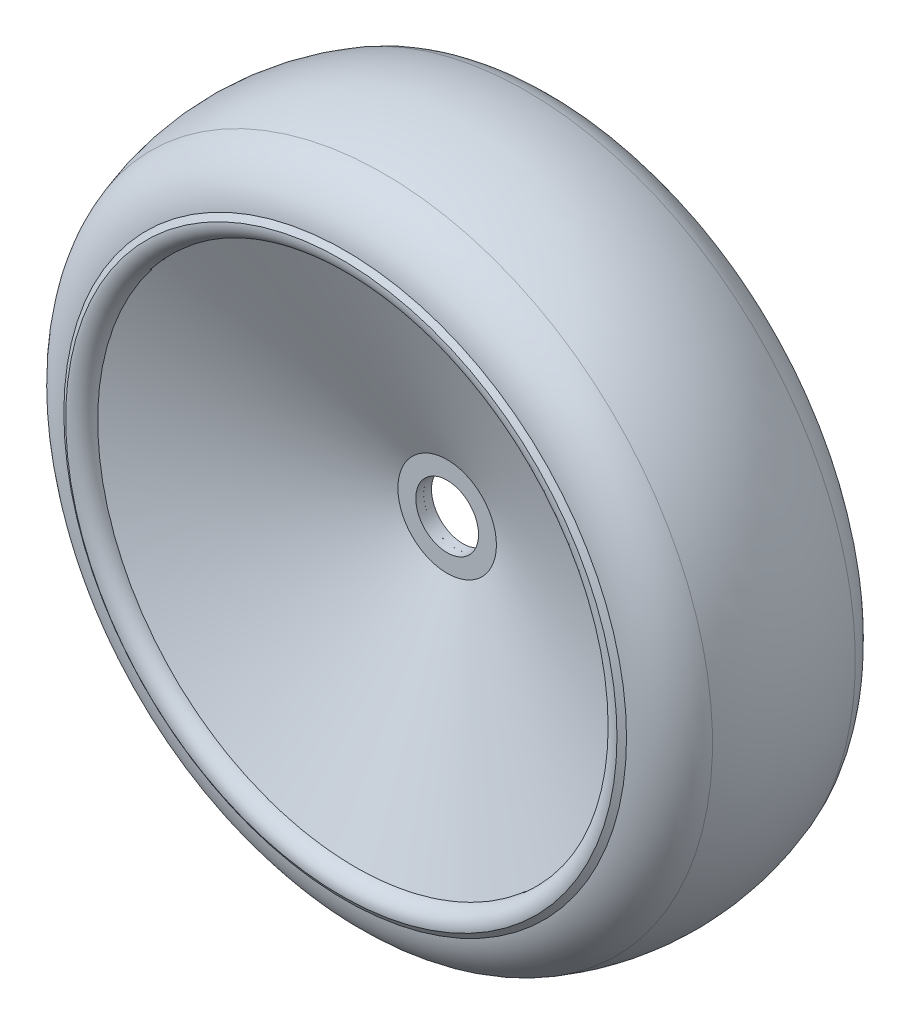
ISO-10303-21;
HEADER;
FILE_DESCRIPTION(('STEP AP214'),'2;1');
FILE_NAME('part.step','',(''),(''),'','','');
FILE_SCHEMA(('AUTOMOTIVE_DESIGN { 1 0 10303 214 1 1 1 1 }'));
ENDSEC;
DATA;
#1=APPLICATION_CONTEXT('core data for automotive mechanical design processes');
#2=APPLICATION_PROTOCOL_DEFINITION('international standard','automotive_design',2000,#1);
#3=PRODUCT_CONTEXT('',#1,'mechanical');
#4=PRODUCT('Part','Part','',(#3));
#5=PRODUCT_RELATED_PRODUCT_CATEGORY('part','',(#4));
#6=PRODUCT_DEFINITION_FORMATION('','',#4);
#7=PRODUCT_DEFINITION_CONTEXT('part definition',#1,'design');
#8=PRODUCT_DEFINITION('design','',#6,#7);
#9=PRODUCT_DEFINITION_SHAPE('','',#8);
#10=(LENGTH_UNIT() NAMED_UNIT(*) SI_UNIT(.MILLI.,.METRE.));
#11=(NAMED_UNIT(*) PLANE_ANGLE_UNIT() SI_UNIT($,.RADIAN.));
#12=(NAMED_UNIT(*) SI_UNIT($,.STERADIAN.) SOLID_ANGLE_UNIT());
#13=UNCERTAINTY_MEASURE_WITH_UNIT(LENGTH_MEASURE(1.E-05),#10,'distance_accuracy_value','');
#14=(GEOMETRIC_REPRESENTATION_CONTEXT(3) GLOBAL_UNCERTAINTY_ASSIGNED_CONTEXT((#13)) GLOBAL_UNIT_ASSIGNED_CONTEXT((#10,
#11,#12)) REPRESENTATION_CONTEXT('',''));
#15=CARTESIAN_POINT('',(0.,0.,0.));
#16=DIRECTION('',(0.,0.,1.));
#17=DIRECTION('',(1.,0.,0.));
#18=AXIS2_PLACEMENT_3D('',#15,#16,#17);
#19=CARTESIAN_POINT('',(0.,0.,-12.5098077692924));
#20=DIRECTION('',(0.,0.,1.));
#21=DIRECTION('',(1.,0.,0.));
#22=AXIS2_PLACEMENT_3D('',#19,#20,#21);
#23=TOROIDAL_SURFACE('',#22,34.8602883460614,2.);
#24=CARTESIAN_POINT('',(0.,0.,-14.4901922307076));
#25=DIRECTION('',(0.,0.,1.));
#26=DIRECTION('',(1.,0.,0.));
#27=AXIS2_PLACEMENT_3D('',#24,#25,#26);
#28=CIRCLE('',#27,35.1397116539386);
#29=CARTESIAN_POINT('',(35.1397116539386,0.,-14.4901922307076));
#30=VERTEX_POINT('',#29);
#31=EDGE_CURVE('E11',#30,#30,#28,.T.);
#32=ORIENTED_EDGE('',*,*,#31,.F.);
#33=EDGE_LOOP('',(#32));
#34=FACE_BOUND('',#33,.T.);
#35=CARTESIAN_POINT('',(0.,0.,-11.7754187242298));
#36=DIRECTION('',(0.,0.,1.));
#37=DIRECTION('',(1.,0.,0.));
#38=AXIS2_PLACEMENT_3D('',#35,#36,#37);
#39=CIRCLE('',#38,33.);
#40=CARTESIAN_POINT('',(33.,0.,-11.7754187242298));
#41=VERTEX_POINT('',#40);
#42=EDGE_CURVE('E79',#41,#41,#39,.T.);
#43=ORIENTED_EDGE('',*,*,#42,.T.);
#44=EDGE_LOOP('',(#43));
#45=FACE_BOUND('',#44,.T.);
#46=ADVANCED_FACE('F45',(#34,#45),#23,.T.);
#47=CARTESIAN_POINT('',(0.,0.,-14.));
#48=DIRECTION('',(0.,0.,1.));
#49=DIRECTION('',(1.,0.,0.));
#50=AXIS2_PLACEMENT_3D('',#47,#48,#49);
#51=CONICAL_SURFACE('',#50,35.8660254037844,0.977112447887286);
#52=ORIENTED_EDGE('',*,*,#31,.T.);
#53=EDGE_LOOP('',(#52));
#54=FACE_BOUND('',#53,.T.);
#55=CARTESIAN_POINT('',(0.,0.,-14.));
#56=DIRECTION('',(0.,0.,1.));
#57=DIRECTION('',(1.,0.,0.));
#58=AXIS2_PLACEMENT_3D('',#55,#56,#57);
#59=CIRCLE('',#58,35.8660254037844);
#60=CARTESIAN_POINT('',(35.8660254037844,0.,-14.));
#61=VERTEX_POINT('',#60);
#62=EDGE_CURVE('E51',#61,#61,#59,.T.);
#63=ORIENTED_EDGE('',*,*,#62,.F.);
#64=EDGE_LOOP('',(#63));
#65=FACE_BOUND('',#64,.T.);
#66=ADVANCED_FACE('F130',(#54,#65),#51,.T.);
#67=CARTESIAN_POINT('',(0.,0.,-14.5));
#68=DIRECTION('',(0.,0.,1.));
#69=DIRECTION('',(1.,0.,0.));
#70=AXIS2_PLACEMENT_3D('',#67,#68,#69);
#71=TOROIDAL_SURFACE('',#70,35.,1.);
#72=ORIENTED_EDGE('',*,*,#62,.T.);
#73=EDGE_LOOP('',(#72));
#74=FACE_BOUND('',#73,.T.);
#75=CARTESIAN_POINT('',(0.,0.,-13.5));
#76=DIRECTION('',(0.,0.,1.));
#77=DIRECTION('',(1.,0.,0.));
#78=AXIS2_PLACEMENT_3D('',#75,#76,#77);
#79=CIRCLE('',#78,35.);
#80=CARTESIAN_POINT('',(35.,0.,-13.5));
#81=VERTEX_POINT('',#80);
#82=EDGE_CURVE('E55',#81,#81,#79,.T.);
#83=ORIENTED_EDGE('',*,*,#82,.F.);
#84=EDGE_LOOP('',(#83));
#85=FACE_BOUND('',#84,.T.);
#86=ADVANCED_FACE('F135',(#74,#85),#71,.T.);
#87=CARTESIAN_POINT('',(0.,0.,-12.5098077692924));
#88=DIRECTION('',(0.,0.,1.));
#89=DIRECTION('',(1.,0.,0.));
#90=AXIS2_PLACEMENT_3D('',#87,#88,#89);
#91=TOROIDAL_SURFACE('',#90,34.8602883460614,0.999999999999998);
#92=ORIENTED_EDGE('',*,*,#82,.T.);
#93=EDGE_LOOP('',(#92));
#94=FACE_BOUND('',#93,.T.);
#95=CARTESIAN_POINT('',(0.,0.,-12.));
#96=DIRECTION('',(0.,0.,1.));
#97=DIRECTION('',(1.,0.,0.));
#98=AXIS2_PLACEMENT_3D('',#95,#96,#97);
#99=CIRCLE('',#98,34.);
#100=CARTESIAN_POINT('',(34.,0.,-12.));
#101=VERTEX_POINT('',#100);
#102=EDGE_CURVE('E59',#101,#101,#99,.T.);
#103=ORIENTED_EDGE('',*,*,#102,.F.);
#104=EDGE_LOOP('',(#103));
#105=FACE_BOUND('',#104,.T.);
#106=ADVANCED_FACE('F204',(#94,#105),#91,.F.);
#107=CARTESIAN_POINT('',(0.,0.,0.));
#108=DIRECTION('',(0.,0.,1.));
#109=DIRECTION('',(1.,0.,0.));
#110=AXIS2_PLACEMENT_3D('',#107,#108,#109);
#111=CYLINDRICAL_SURFACE('',#110,34.);
#112=ORIENTED_EDGE('',*,*,#102,.T.);
#113=EDGE_LOOP('',(#112));
#114=FACE_BOUND('',#113,.T.);
#115=CARTESIAN_POINT('',(0.,0.,-2.));
#116=DIRECTION('',(0.,0.,1.));
#117=DIRECTION('',(1.,0.,0.));
#118=AXIS2_PLACEMENT_3D('',#115,#116,#117);
#119=CIRCLE('',#118,34.);
#120=CARTESIAN_POINT('',(34.,0.,-2.));
#121=VERTEX_POINT('',#120);
#122=EDGE_CURVE('E64',#121,#121,#119,.T.);
#123=ORIENTED_EDGE('',*,*,#122,.F.);
#124=EDGE_LOOP('',(#123));
#125=FACE_BOUND('',#124,.T.);
#126=ADVANCED_FACE('F198',(#114,#125),#111,.T.);
#127=CARTESIAN_POINT('',(0.,0.,-2.));
#128=DIRECTION('',(0.,0.,1.));
#129=DIRECTION('',(1.,0.,0.));
#130=AXIS2_PLACEMENT_3D('',#127,#128,#129);
#131=TOROIDAL_SURFACE('',#130,32.,2.);
#132=ORIENTED_EDGE('',*,*,#122,.T.);
#133=EDGE_LOOP('',(#132));
#134=FACE_BOUND('',#133,.T.);
#135=CARTESIAN_POINT('',(0.,0.,0.));
#136=DIRECTION('',(0.,0.,1.));
#137=DIRECTION('',(1.,0.,0.));
#138=AXIS2_PLACEMENT_3D('',#135,#136,#137);
#139=CIRCLE('',#138,32.);
#140=CARTESIAN_POINT('',(32.,0.,0.));
#141=VERTEX_POINT('',#140);
#142=EDGE_CURVE('E67',#141,#141,#139,.T.);
#143=ORIENTED_EDGE('',*,*,#142,.F.);
#144=EDGE_LOOP('',(#143));
#145=FACE_BOUND('',#144,.T.);
#146=ADVANCED_FACE('F155',(#134,#145),#131,.T.);
#147=CARTESIAN_POINT('',(0.,0.,0.));
#148=DIRECTION('',(0.,0.,1.));
#149=DIRECTION('',(1.,0.,0.));
#150=AXIS2_PLACEMENT_3D('',#147,#148,#149);
#151=CYLINDRICAL_SURFACE('',#150,4.);
#152=CARTESIAN_POINT('',(0.,0.,-1.));
#153=DIRECTION('',(0.,0.,1.));
#154=DIRECTION('',(1.,0.,0.));
#155=AXIS2_PLACEMENT_3D('',#152,#153,#154);
#156=CIRCLE('',#155,4.);
#157=CARTESIAN_POINT('',(4.,0.,-1.));
#158=VERTEX_POINT('',#157);
#159=EDGE_CURVE('E70',#158,#158,#156,.T.);
#160=ORIENTED_EDGE('',*,*,#159,.F.);
#161=EDGE_LOOP('',(#160));
#162=FACE_BOUND('',#161,.T.);
#163=CARTESIAN_POINT('',(0.,0.,1.));
#164=DIRECTION('',(0.,0.,1.));
#165=DIRECTION('',(1.,0.,0.));
#166=AXIS2_PLACEMENT_3D('',#163,#164,#165);
#167=CIRCLE('',#166,4.);
#168=CARTESIAN_POINT('',(4.,0.,1.));
#169=VERTEX_POINT('',#168);
#170=EDGE_CURVE('E97',#169,#169,#167,.T.);
#171=ORIENTED_EDGE('',*,*,#170,.T.);
#172=EDGE_LOOP('',(#171));
#173=FACE_BOUND('',#172,.T.);
#174=ADVANCED_FACE('F149',(#162,#173),#151,.F.);
#175=CARTESIAN_POINT('',(0.,32.,-1.));
#176=DIRECTION('',(0.,0.,1.));
#177=DIRECTION('',(1.,0.,0.));
#178=AXIS2_PLACEMENT_3D('',#175,#176,#177);
#179=PLANE('',#178);
#180=CARTESIAN_POINT('',(0.,0.,-0.999999999999999));
#181=DIRECTION('',(0.,0.,1.));
#182=DIRECTION('',(1.,0.,0.));
#183=AXIS2_PLACEMENT_3D('',#180,#181,#182);
#184=CIRCLE('',#183,32.);
#185=CARTESIAN_POINT('',(32.,0.,-0.999999999999999));
#186=VERTEX_POINT('',#185);
#187=EDGE_CURVE('E73',#186,#186,#184,.T.);
#188=ORIENTED_EDGE('',*,*,#187,.F.);
#189=EDGE_LOOP('',(#188));
#190=FACE_BOUND('',#189,.T.);
#191=ORIENTED_EDGE('',*,*,#159,.T.);
#192=EDGE_LOOP('',(#191));
#193=FACE_BOUND('',#192,.T.);
#194=ADVANCED_FACE('F143',(#190,#193),#179,.F.);
#195=CARTESIAN_POINT('',(0.,0.,-2.));
#196=DIRECTION('',(0.,0.,1.));
#197=DIRECTION('',(1.,0.,0.));
#198=AXIS2_PLACEMENT_3D('',#195,#196,#197);
#199=TOROIDAL_SURFACE('',#198,32.,1.);
#200=CARTESIAN_POINT('',(0.,0.,-2.));
#201=DIRECTION('',(0.,0.,1.));
#202=DIRECTION('',(1.,0.,0.));
#203=AXIS2_PLACEMENT_3D('',#200,#201,#202);
#204=CIRCLE('',#203,33.);
#205=CARTESIAN_POINT('',(33.,0.,-2.));
#206=VERTEX_POINT('',#205);
#207=EDGE_CURVE('E76',#206,#206,#204,.T.);
#208=ORIENTED_EDGE('',*,*,#207,.F.);
#209=EDGE_LOOP('',(#208));
#210=FACE_BOUND('',#209,.T.);
#211=ORIENTED_EDGE('',*,*,#187,.T.);
#212=EDGE_LOOP('',(#211));
#213=FACE_BOUND('',#212,.T.);
#214=ADVANCED_FACE('F126',(#210,#213),#199,.F.);
#215=CARTESIAN_POINT('',(0.,0.,0.));
#216=DIRECTION('',(0.,0.,1.));
#217=DIRECTION('',(1.,0.,0.));
#218=AXIS2_PLACEMENT_3D('',#215,#216,#217);
#219=CYLINDRICAL_SURFACE('',#218,33.);
#220=ORIENTED_EDGE('',*,*,#42,.F.);
#221=EDGE_LOOP('',(#220));
#222=FACE_BOUND('',#221,.T.);
#223=ORIENTED_EDGE('',*,*,#207,.T.);
#224=EDGE_LOOP('',(#223));
#225=FACE_BOUND('',#224,.T.);
#226=ADVANCED_FACE('F116',(#222,#225),#219,.F.);
#227=CARTESIAN_POINT('',(0.,0.,12.5098077692924));
#228=DIRECTION('',(0.,0.,-1.));
#229=DIRECTION('',(1.,0.,0.));
#230=AXIS2_PLACEMENT_3D('',#227,#228,#229);
#231=TOROIDAL_SURFACE('',#230,34.8602883460614,2.);
#232=CARTESIAN_POINT('',(0.,0.,14.4901922307076));
#233=DIRECTION('',(0.,0.,1.));
#234=DIRECTION('',(1.,0.,0.));
#235=AXIS2_PLACEMENT_3D('',#232,#233,#234);
#236=CIRCLE('',#235,35.1397116539386);
#237=CARTESIAN_POINT('',(35.1397116539386,0.,14.4901922307076));
#238=VERTEX_POINT('',#237);
#239=EDGE_CURVE('E82',#238,#238,#236,.T.);
#240=ORIENTED_EDGE('',*,*,#239,.T.);
#241=EDGE_LOOP('',(#240));
#242=FACE_BOUND('',#241,.T.);
#243=CARTESIAN_POINT('',(0.,0.,11.7754187242298));
#244=DIRECTION('',(0.,0.,1.));
#245=DIRECTION('',(1.,0.,0.));
#246=AXIS2_PLACEMENT_3D('',#243,#244,#245);
#247=CIRCLE('',#246,33.);
#248=CARTESIAN_POINT('',(33.,0.,11.7754187242298));
#249=VERTEX_POINT('',#248);
#250=EDGE_CURVE('E106',#249,#249,#247,.T.);
#251=ORIENTED_EDGE('',*,*,#250,.F.);
#252=EDGE_LOOP('',(#251));
#253=FACE_BOUND('',#252,.T.);
#254=ADVANCED_FACE('F113',(#242,#253),#231,.T.);
#255=CARTESIAN_POINT('',(0.,0.,14.));
#256=DIRECTION('',(0.,0.,-1.));
#257=DIRECTION('',(1.,0.,0.));
#258=AXIS2_PLACEMENT_3D('',#255,#256,#257);
#259=CONICAL_SURFACE('',#258,35.8660254037844,0.977112447887286);
#260=ORIENTED_EDGE('',*,*,#239,.F.);
#261=EDGE_LOOP('',(#260));
#262=FACE_BOUND('',#261,.T.);
#263=CARTESIAN_POINT('',(0.,0.,14.));
#264=DIRECTION('',(0.,0.,1.));
#265=DIRECTION('',(1.,0.,0.));
#266=AXIS2_PLACEMENT_3D('',#263,#264,#265);
#267=CIRCLE('',#266,35.8660254037844);
#268=CARTESIAN_POINT('',(35.8660254037844,0.,14.));
#269=VERTEX_POINT('',#268);
#270=EDGE_CURVE('E85',#269,#269,#267,.T.);
#271=ORIENTED_EDGE('',*,*,#270,.T.);
#272=EDGE_LOOP('',(#271));
#273=FACE_BOUND('',#272,.T.);
#274=ADVANCED_FACE('F115',(#262,#273),#259,.T.);
#275=CARTESIAN_POINT('',(0.,0.,14.5));
#276=DIRECTION('',(0.,0.,-1.));
#277=DIRECTION('',(1.,0.,0.));
#278=AXIS2_PLACEMENT_3D('',#275,#276,#277);
#279=TOROIDAL_SURFACE('',#278,35.,1.);
#280=ORIENTED_EDGE('',*,*,#270,.F.);
#281=EDGE_LOOP('',(#280));
#282=FACE_BOUND('',#281,.T.);
#283=CARTESIAN_POINT('',(0.,0.,13.5));
#284=DIRECTION('',(0.,0.,1.));
#285=DIRECTION('',(1.,0.,0.));
#286=AXIS2_PLACEMENT_3D('',#283,#284,#285);
#287=CIRCLE('',#286,35.);
#288=CARTESIAN_POINT('',(35.,0.,13.5));
#289=VERTEX_POINT('',#288);
#290=EDGE_CURVE('E88',#289,#289,#287,.T.);
#291=ORIENTED_EDGE('',*,*,#290,.T.);
#292=EDGE_LOOP('',(#291));
#293=FACE_BOUND('',#292,.T.);
#294=ADVANCED_FACE('F123',(#282,#293),#279,.T.);
#295=CARTESIAN_POINT('',(0.,0.,12.5098077692924));
#296=DIRECTION('',(0.,0.,-1.));
#297=DIRECTION('',(1.,0.,0.));
#298=AXIS2_PLACEMENT_3D('',#295,#296,#297);
#299=TOROIDAL_SURFACE('',#298,34.8602883460614,0.999999999999998);
#300=ORIENTED_EDGE('',*,*,#290,.F.);
#301=EDGE_LOOP('',(#300));
#302=FACE_BOUND('',#301,.T.);
#303=CARTESIAN_POINT('',(0.,0.,12.));
#304=DIRECTION('',(0.,0.,1.));
#305=DIRECTION('',(1.,0.,0.));
#306=AXIS2_PLACEMENT_3D('',#303,#304,#305);
#307=CIRCLE('',#306,34.);
#308=CARTESIAN_POINT('',(34.,0.,12.));
#309=VERTEX_POINT('',#308);
#310=EDGE_CURVE('E91',#309,#309,#307,.T.);
#311=ORIENTED_EDGE('',*,*,#310,.T.);
#312=EDGE_LOOP('',(#311));
#313=FACE_BOUND('',#312,.T.);
#314=ADVANCED_FACE('F178',(#302,#313),#299,.F.);
#315=CARTESIAN_POINT('',(0.,0.,0.));
#316=DIRECTION('',(0.,0.,-1.));
#317=DIRECTION('',(1.,0.,0.));
#318=AXIS2_PLACEMENT_3D('',#315,#316,#317);
#319=CYLINDRICAL_SURFACE('',#318,34.);
#320=ORIENTED_EDGE('',*,*,#310,.F.);
#321=EDGE_LOOP('',(#320));
#322=FACE_BOUND('',#321,.T.);
#323=CARTESIAN_POINT('',(0.,0.,2.));
#324=DIRECTION('',(0.,0.,1.));
#325=DIRECTION('',(1.,0.,0.));
#326=AXIS2_PLACEMENT_3D('',#323,#324,#325);
#327=CIRCLE('',#326,34.);
#328=CARTESIAN_POINT('',(34.,0.,2.));
#329=VERTEX_POINT('',#328);
#330=EDGE_CURVE('E94',#329,#329,#327,.T.);
#331=ORIENTED_EDGE('',*,*,#330,.T.);
#332=EDGE_LOOP('',(#331));
#333=FACE_BOUND('',#332,.T.);
#334=ADVANCED_FACE('F171',(#322,#333),#319,.T.);
#335=CARTESIAN_POINT('',(0.,0.,2.));
#336=DIRECTION('',(0.,0.,-1.));
#337=DIRECTION('',(1.,0.,0.));
#338=AXIS2_PLACEMENT_3D('',#335,#336,#337);
#339=TOROIDAL_SURFACE('',#338,32.,2.);
#340=ORIENTED_EDGE('',*,*,#330,.F.);
#341=EDGE_LOOP('',(#340));
#342=FACE_BOUND('',#341,.T.);
#343=ORIENTED_EDGE('',*,*,#142,.T.);
#344=EDGE_LOOP('',(#343));
#345=FACE_BOUND('',#344,.T.);
#346=ADVANCED_FACE('F162',(#342,#345),#339,.T.);
#347=CARTESIAN_POINT('',(0.,32.,1.));
#348=DIRECTION('',(0.,0.,-1.));
#349=DIRECTION('',(1.,0.,0.));
#350=AXIS2_PLACEMENT_3D('',#347,#348,#349);
#351=PLANE('',#350);
#352=CARTESIAN_POINT('',(0.,0.,0.999999999999999));
#353=DIRECTION('',(0.,0.,1.));
#354=DIRECTION('',(1.,0.,0.));
#355=AXIS2_PLACEMENT_3D('',#352,#353,#354);
#356=CIRCLE('',#355,32.);
#357=CARTESIAN_POINT('',(32.,0.,0.999999999999999));
#358=VERTEX_POINT('',#357);
#359=EDGE_CURVE('E100',#358,#358,#356,.T.);
#360=ORIENTED_EDGE('',*,*,#359,.T.);
#361=EDGE_LOOP('',(#360));
#362=FACE_BOUND('',#361,.T.);
#363=ORIENTED_EDGE('',*,*,#170,.F.);
#364=EDGE_LOOP('',(#363));
#365=FACE_BOUND('',#364,.T.);
#366=ADVANCED_FACE('F159',(#362,#365),#351,.F.);
#367=CARTESIAN_POINT('',(0.,0.,2.));
#368=DIRECTION('',(0.,0.,-1.));
#369=DIRECTION('',(1.,0.,0.));
#370=AXIS2_PLACEMENT_3D('',#367,#368,#369);
#371=TOROIDAL_SURFACE('',#370,32.,1.);
#372=CARTESIAN_POINT('',(0.,0.,2.));
#373=DIRECTION('',(0.,0.,1.));
#374=DIRECTION('',(1.,0.,0.));
#375=AXIS2_PLACEMENT_3D('',#372,#373,#374);
#376=CIRCLE('',#375,33.);
#377=CARTESIAN_POINT('',(33.,0.,2.));
#378=VERTEX_POINT('',#377);
#379=EDGE_CURVE('E103',#378,#378,#376,.T.);
#380=ORIENTED_EDGE('',*,*,#379,.T.);
#381=EDGE_LOOP('',(#380));
#382=FACE_BOUND('',#381,.T.);
#383=ORIENTED_EDGE('',*,*,#359,.F.);
#384=EDGE_LOOP('',(#383));
#385=FACE_BOUND('',#384,.T.);
#386=ADVANCED_FACE('F161',(#382,#385),#371,.F.);
#387=CARTESIAN_POINT('',(0.,0.,0.));
#388=DIRECTION('',(0.,0.,-1.));
#389=DIRECTION('',(1.,0.,0.));
#390=AXIS2_PLACEMENT_3D('',#387,#388,#389);
#391=CYLINDRICAL_SURFACE('',#390,33.);
#392=ORIENTED_EDGE('',*,*,#250,.T.);
#393=EDGE_LOOP('',(#392));
#394=FACE_BOUND('',#393,.T.);
#395=ORIENTED_EDGE('',*,*,#379,.F.);
#396=EDGE_LOOP('',(#395));
#397=FACE_BOUND('',#396,.T.);
#398=ADVANCED_FACE('F110',(#394,#397),#391,.F.);
#399=CLOSED_SHELL('',(#46,#66,#86,#106,#126,#146,#174,#194,#214,#226,#254,#274,#294,#314,#334,
#346,#366,#386,#398));
#400=MANIFOLD_SOLID_BREP('B2',#399);
#401=CARTESIAN_POINT('',(0.,0.,0.));
#402=DIRECTION('',(0.,0.,-1.));
#403=DIRECTION('',(-1.,0.,0.));
#404=AXIS2_PLACEMENT_3D('',#401,#402,#403);
#405=CONICAL_SURFACE('',#404,4.,1.15684305136467);
#406=CARTESIAN_POINT('',(0.,0.,-14.));
#407=DIRECTION('',(0.,0.,-1.));
#408=DIRECTION('',(-1.,0.,0.));
#409=AXIS2_PLACEMENT_3D('',#406,#407,#408);
#410=CIRCLE('',#409,35.8660254037844);
#411=CARTESIAN_POINT('',(-35.8660254037844,0.,-14.));
#412=VERTEX_POINT('',#411);
#413=EDGE_CURVE('E359',#412,#412,#410,.T.);
#414=CARTESIAN_POINT('',(0.,0.,0.));
#415=DIRECTION('',(0.,0.,-1.));
#416=DIRECTION('',(-1.,0.,0.));
#417=AXIS2_PLACEMENT_3D('',#414,#415,#416);
#418=CIRCLE('',#417,4.);
#419=CARTESIAN_POINT('',(-4.,0.,0.));
#420=VERTEX_POINT('',#419);
#421=EDGE_CURVE('E44',#420,#420,#418,.T.);
#422=CARTESIAN_POINT('',(-35.8660254037844,0.,-14.));
#423=CARTESIAN_POINT('',(-35.5340876391617,0.,-13.8541666666667));
#424=CARTESIAN_POINT('',(-35.2021498745389,0.,-13.7083333333333));
#425=CARTESIAN_POINT('',(-34.5382743452934,0.,-13.4166666666667));
#426=CARTESIAN_POINT('',(-34.2063365806707,0.,-13.2708333333333));
#427=CARTESIAN_POINT('',(-33.5424610514252,0.,-12.9791666666667));
#428=CARTESIAN_POINT('',(-33.2105232868024,0.,-12.8333333333333));
#429=CARTESIAN_POINT('',(-32.5466477575569,0.,-12.5416666666667));
#430=CARTESIAN_POINT('',(-32.2147099929341,0.,-12.3958333333333));
#431=CARTESIAN_POINT('',(-31.5508344636886,0.,-12.1041666666667));
#432=CARTESIAN_POINT('',(-31.2188966990659,0.,-11.9583333333333));
#433=CARTESIAN_POINT('',(-30.5550211698204,0.,-11.6666666666667));
#434=CARTESIAN_POINT('',(-30.2230834051976,0.,-11.5208333333333));
#435=CARTESIAN_POINT('',(-29.5592078759521,0.,-11.2291666666667));
#436=CARTESIAN_POINT('',(-29.2272701113294,0.,-11.0833333333333));
#437=CARTESIAN_POINT('',(-28.5633945820838,0.,-10.7916666666667));
#438=CARTESIAN_POINT('',(-28.2314568174611,0.,-10.6458333333333));
#439=CARTESIAN_POINT('',(-27.5675812882156,0.,-10.3541666666667));
#440=CARTESIAN_POINT('',(-27.2356435235928,0.,-10.2083333333333));
#441=CARTESIAN_POINT('',(-26.5717679943473,0.,-9.91666666666667));
#442=CARTESIAN_POINT('',(-26.2398302297246,0.,-9.77083333333333));
#443=CARTESIAN_POINT('',(-25.5759547004791,0.,-9.47916666666667));
#444=CARTESIAN_POINT('',(-25.2440169358563,0.,-9.33333333333333));
#445=CARTESIAN_POINT('',(-24.5801414066108,0.,-9.04166666666667));
#446=CARTESIAN_POINT('',(-24.248203641988,0.,-8.89583333333333));
#447=CARTESIAN_POINT('',(-23.5843281127425,0.,-8.60416666666667));
#448=CARTESIAN_POINT('',(-23.2523903481198,0.,-8.45833333333333));
#449=CARTESIAN_POINT('',(-22.5885148188743,0.,-8.16666666666667));
#450=CARTESIAN_POINT('',(-22.2565770542515,0.,-8.02083333333333));
#451=CARTESIAN_POINT('',(-21.592701525006,0.,-7.72916666666667));
#452=CARTESIAN_POINT('',(-21.2607637603832,0.,-7.58333333333333));
#453=CARTESIAN_POINT('',(-20.5968882311377,0.,-7.29166666666667));
#454=CARTESIAN_POINT('',(-20.264950466515,0.,-7.14583333333333));
#455=CARTESIAN_POINT('',(-19.6010749372695,0.,-6.85416666666667));
#456=CARTESIAN_POINT('',(-19.2691371726467,0.,-6.70833333333333));
#457=CARTESIAN_POINT('',(-18.6052616434012,0.,-6.41666666666667));
#458=CARTESIAN_POINT('',(-18.2733238787784,0.,-6.27083333333333));
#459=CARTESIAN_POINT('',(-17.6094483495329,0.,-5.97916666666667));
#460=CARTESIAN_POINT('',(-17.2775105849102,0.,-5.83333333333333));
#461=CARTESIAN_POINT('',(-16.6136350556647,0.,-5.54166666666667));
#462=CARTESIAN_POINT('',(-16.2816972910419,0.,-5.39583333333333));
#463=CARTESIAN_POINT('',(-15.6178217617964,0.,-5.10416666666667));
#464=CARTESIAN_POINT('',(-15.2858839971737,0.,-4.95833333333333));
#465=CARTESIAN_POINT('',(-14.6220084679282,0.,-4.66666666666667));
#466=CARTESIAN_POINT('',(-14.2900707033054,0.,-4.52083333333333));
#467=CARTESIAN_POINT('',(-13.6261951740599,0.,-4.22916666666667));
#468=CARTESIAN_POINT('',(-13.2942574094371,0.,-4.08333333333333));
#469=CARTESIAN_POINT('',(-12.6303818801916,0.,-3.79166666666667));
#470=CARTESIAN_POINT('',(-12.2984441155689,0.,-3.64583333333333));
#471=CARTESIAN_POINT('',(-11.6345685863234,0.,-3.35416666666667));
#472=CARTESIAN_POINT('',(-11.3026308217006,0.,-3.20833333333333));
#473=CARTESIAN_POINT('',(-10.6387552924551,0.,-2.91666666666667));
#474=CARTESIAN_POINT('',(-10.3068175278323,0.,-2.77083333333333));
#475=CARTESIAN_POINT('',(-9.64294199858683,0.,-2.47916666666667));
#476=CARTESIAN_POINT('',(-9.31100423396408,0.,-2.33333333333333));
#477=CARTESIAN_POINT('',(-8.64712870471856,0.,-2.04166666666667));
#478=CARTESIAN_POINT('',(-8.31519094009581,0.,-1.89583333333333));
#479=CARTESIAN_POINT('',(-7.6513154108503,0.,-1.60416666666667));
#480=CARTESIAN_POINT('',(-7.31937764622755,0.,-1.45833333333333));
#481=CARTESIAN_POINT('',(-6.65550211698204,0.,-1.16666666666667));
#482=CARTESIAN_POINT('',(-6.32356435235928,0.,-1.02083333333333));
#483=CARTESIAN_POINT('',(-5.65968882311377,0.,-0.729166666666667));
#484=CARTESIAN_POINT('',(-5.32775105849102,0.,-0.583333333333334));
#485=CARTESIAN_POINT('',(-4.66387552924551,0.,-0.291666666666667));
#486=CARTESIAN_POINT('',(-4.33193776462276,0.,-0.145833333333334));
#487=CARTESIAN_POINT('',(-4.,0.,0.));
#488=B_SPLINE_CURVE_WITH_KNOTS('',3,(#422,#423,#424,#425,#426,#427,#428,#429,#430,#431,#432,
#433,#434,#435,#436,#437,#438,#439,#440,#441,#442,#443,#444,#445,#446,#447,#448,#449,#450,#451,
#452,#453,#454,#455,#456,#457,#458,#459,#460,#461,#462,#463,#464,#465,#466,#467,#468,#469,#470,
#471,#472,#473,#474,#475,#476,#477,#478,#479,#480,#481,#482,#483,#484,#485,#486,#487),
.UNSPECIFIED.,.F.,.F.,(4,2,2,2,2,2,2,2,2,2,2,2,2,2,2,2,2,2,2,2,2,2,2,2,2,2,2,2,2,2,2,2,4),(0.,
1.08768118777735,2.17536237555471,3.26304356333207,4.35072475110942,5.43840593888678,
6.52608712666414,7.6137683144415,8.70144950221885,9.78913068999621,10.8768118777736,
11.9644930655509,13.0521742533283,14.1398554411056,15.227536628883,16.3152178166604,
17.4028990044377,18.4905801922151,19.5782613799924,20.6659425677698,21.7536237555471,
22.8413049433245,23.9289861311018,25.0166673188792,26.1043485066566,27.1920296944339,
28.2797108822113,29.3673920699886,30.455073257766,31.5427544455433,32.6304356333207,
33.718116821098,34.8057980088754),.UNSPECIFIED.);
#489=EDGE_CURVE('BSEAM347',#412,#420,#488,.T.);
#490=ORIENTED_EDGE('',*,*,#413,.T.);
#491=ORIENTED_EDGE('',*,*,#421,.F.);
#492=ORIENTED_EDGE('',*,*,#489,.T.);
#493=ORIENTED_EDGE('',*,*,#489,.F.);
#494=EDGE_LOOP('',(#490,#492,#491,#493));
#495=FACE_BOUND('',#494,.T.);
#496=ADVANCED_FACE('F347',(#495),#405,.F.);
#497=CARTESIAN_POINT('',(0.,0.,0.));
#498=DIRECTION('',(0.,0.,-1.));
#499=DIRECTION('',(-1.,0.,0.));
#500=AXIS2_PLACEMENT_3D('',#497,#498,#499);
#501=DEGENERATE_TOROIDAL_SURFACE('',#500,16.1463796452362,27.3452717748061,.T.);
#502=CARTESIAN_POINT('',(0.,0.,-9.1041224667576));
#503=DIRECTION('',(0.,0.,-1.));
#504=DIRECTION('',(-1.,0.,0.));
#505=AXIS2_PLACEMENT_3D('',#502,#503,#504);
#506=CIRCLE('',#505,41.9316243124541);
#507=CARTESIAN_POINT('',(-41.9316243124541,0.,-9.1041224667576));
#508=VERTEX_POINT('',#507);
#509=EDGE_CURVE('E354',#508,#508,#506,.T.);
#510=ORIENTED_EDGE('',*,*,#509,.F.);
#511=EDGE_LOOP('',(#510));
#512=FACE_BOUND('',#511,.T.);
#513=CARTESIAN_POINT('',(0.,0.,9.1041224667576));
#514=DIRECTION('',(0.,0.,-1.));
#515=DIRECTION('',(-1.,0.,0.));
#516=AXIS2_PLACEMENT_3D('',#513,#514,#515);
#517=CIRCLE('',#516,41.9316243124541);
#518=CARTESIAN_POINT('',(-41.9316243124541,0.,9.1041224667576));
#519=VERTEX_POINT('',#518);
#520=EDGE_CURVE('E364',#519,#519,#517,.T.);
#521=ORIENTED_EDGE('',*,*,#520,.T.);
#522=EDGE_LOOP('',(#521));
#523=FACE_BOUND('',#522,.T.);
#524=ADVANCED_FACE('F387',(#512,#523),#501,.T.);
#525=CARTESIAN_POINT('',(0.,0.,-6.63083641828001));
#526=DIRECTION('',(0.,0.,-1.));
#527=DIRECTION('',(-1.,0.,0.));
#528=AXIS2_PLACEMENT_3D('',#525,#526,#527);
#529=TOROIDAL_SURFACE('',#528,34.9266344164071,7.42879716517513);
#530=ORIENTED_EDGE('',*,*,#509,.T.);
#531=EDGE_LOOP('',(#530));
#532=FACE_BOUND('',#531,.T.);
#533=ORIENTED_EDGE('',*,*,#413,.F.);
#534=EDGE_LOOP('',(#533));
#535=FACE_BOUND('',#534,.T.);
#536=ADVANCED_FACE('F379',(#532,#535),#529,.T.);
#537=CARTESIAN_POINT('',(0.,0.,0.));
#538=DIRECTION('',(0.,0.,1.));
#539=DIRECTION('',(-1.,0.,0.));
#540=AXIS2_PLACEMENT_3D('',#537,#538,#539);
#541=CONICAL_SURFACE('',#540,4.,1.15684305136467);
#542=CARTESIAN_POINT('',(0.,0.,14.));
#543=DIRECTION('',(0.,0.,-1.));
#544=DIRECTION('',(-1.,0.,0.));
#545=AXIS2_PLACEMENT_3D('',#542,#543,#544);
#546=CIRCLE('',#545,35.8660254037844);
#547=CARTESIAN_POINT('',(-35.8660254037844,0.,14.));
#548=VERTEX_POINT('',#547);
#549=EDGE_CURVE('E370',#548,#548,#546,.T.);
#550=CARTESIAN_POINT('',(-35.8660254037844,0.,14.));
#551=CARTESIAN_POINT('',(-35.5340876391617,0.,13.8541666666667));
#552=CARTESIAN_POINT('',(-35.2021498745389,0.,13.7083333333333));
#553=CARTESIAN_POINT('',(-34.5382743452934,0.,13.4166666666667));
#554=CARTESIAN_POINT('',(-34.2063365806707,0.,13.2708333333333));
#555=CARTESIAN_POINT('',(-33.5424610514252,0.,12.9791666666667));
#556=CARTESIAN_POINT('',(-33.2105232868024,0.,12.8333333333333));
#557=CARTESIAN_POINT('',(-32.5466477575569,0.,12.5416666666667));
#558=CARTESIAN_POINT('',(-32.2147099929341,0.,12.3958333333333));
#559=CARTESIAN_POINT('',(-31.5508344636886,0.,12.1041666666667));
#560=CARTESIAN_POINT('',(-31.2188966990659,0.,11.9583333333333));
#561=CARTESIAN_POINT('',(-30.5550211698204,0.,11.6666666666667));
#562=CARTESIAN_POINT('',(-30.2230834051976,0.,11.5208333333333));
#563=CARTESIAN_POINT('',(-29.5592078759521,0.,11.2291666666667));
#564=CARTESIAN_POINT('',(-29.2272701113294,0.,11.0833333333333));
#565=CARTESIAN_POINT('',(-28.5633945820838,0.,10.7916666666667));
#566=CARTESIAN_POINT('',(-28.2314568174611,0.,10.6458333333333));
#567=CARTESIAN_POINT('',(-27.5675812882156,0.,10.3541666666667));
#568=CARTESIAN_POINT('',(-27.2356435235928,0.,10.2083333333333));
#569=CARTESIAN_POINT('',(-26.5717679943473,0.,9.91666666666667));
#570=CARTESIAN_POINT('',(-26.2398302297246,0.,9.77083333333333));
#571=CARTESIAN_POINT('',(-25.5759547004791,0.,9.47916666666667));
#572=CARTESIAN_POINT('',(-25.2440169358563,0.,9.33333333333333));
#573=CARTESIAN_POINT('',(-24.5801414066108,0.,9.04166666666667));
#574=CARTESIAN_POINT('',(-24.248203641988,0.,8.89583333333333));
#575=CARTESIAN_POINT('',(-23.5843281127425,0.,8.60416666666667));
#576=CARTESIAN_POINT('',(-23.2523903481198,0.,8.45833333333333));
#577=CARTESIAN_POINT('',(-22.5885148188743,0.,8.16666666666667));
#578=CARTESIAN_POINT('',(-22.2565770542515,0.,8.02083333333333));
#579=CARTESIAN_POINT('',(-21.592701525006,0.,7.72916666666667));
#580=CARTESIAN_POINT('',(-21.2607637603832,0.,7.58333333333333));
#581=CARTESIAN_POINT('',(-20.5968882311377,0.,7.29166666666667));
#582=CARTESIAN_POINT('',(-20.264950466515,0.,7.14583333333333));
#583=CARTESIAN_POINT('',(-19.6010749372695,0.,6.85416666666667));
#584=CARTESIAN_POINT('',(-19.2691371726467,0.,6.70833333333333));
#585=CARTESIAN_POINT('',(-18.6052616434012,0.,6.41666666666667));
#586=CARTESIAN_POINT('',(-18.2733238787784,0.,6.27083333333333));
#587=CARTESIAN_POINT('',(-17.6094483495329,0.,5.97916666666667));
#588=CARTESIAN_POINT('',(-17.2775105849102,0.,5.83333333333333));
#589=CARTESIAN_POINT('',(-16.6136350556647,0.,5.54166666666667));
#590=CARTESIAN_POINT('',(-16.2816972910419,0.,5.39583333333333));
#591=CARTESIAN_POINT('',(-15.6178217617964,0.,5.10416666666667));
#592=CARTESIAN_POINT('',(-15.2858839971737,0.,4.95833333333333));
#593=CARTESIAN_POINT('',(-14.6220084679282,0.,4.66666666666667));
#594=CARTESIAN_POINT('',(-14.2900707033054,0.,4.52083333333333));
#595=CARTESIAN_POINT('',(-13.6261951740599,0.,4.22916666666667));
#596=CARTESIAN_POINT('',(-13.2942574094371,0.,4.08333333333333));
#597=CARTESIAN_POINT('',(-12.6303818801916,0.,3.79166666666667));
#598=CARTESIAN_POINT('',(-12.2984441155689,0.,3.64583333333333));
#599=CARTESIAN_POINT('',(-11.6345685863234,0.,3.35416666666667));
#600=CARTESIAN_POINT('',(-11.3026308217006,0.,3.20833333333333));
#601=CARTESIAN_POINT('',(-10.6387552924551,0.,2.91666666666667));
#602=CARTESIAN_POINT('',(-10.3068175278323,0.,2.77083333333333));
#603=CARTESIAN_POINT('',(-9.64294199858683,0.,2.47916666666667));
#604=CARTESIAN_POINT('',(-9.31100423396408,0.,2.33333333333333));
#605=CARTESIAN_POINT('',(-8.64712870471856,0.,2.04166666666667));
#606=CARTESIAN_POINT('',(-8.31519094009581,0.,1.89583333333333));
#607=CARTESIAN_POINT('',(-7.6513154108503,0.,1.60416666666667));
#608=CARTESIAN_POINT('',(-7.31937764622755,0.,1.45833333333333));
#609=CARTESIAN_POINT('',(-6.65550211698204,0.,1.16666666666667));
#610=CARTESIAN_POINT('',(-6.32356435235928,0.,1.02083333333333));
#611=CARTESIAN_POINT('',(-5.65968882311377,0.,0.729166666666667));
#612=CARTESIAN_POINT('',(-5.32775105849102,0.,0.583333333333334));
#613=CARTESIAN_POINT('',(-4.66387552924551,0.,0.291666666666667));
#614=CARTESIAN_POINT('',(-4.33193776462276,0.,0.145833333333334));
#615=CARTESIAN_POINT('',(-4.,0.,0.));
#616=B_SPLINE_CURVE_WITH_KNOTS('',3,(#550,#551,#552,#553,#554,#555,#556,#557,#558,#559,#560,
#561,#562,#563,#564,#565,#566,#567,#568,#569,#570,#571,#572,#573,#574,#575,#576,#577,#578,#579,
#580,#581,#582,#583,#584,#585,#586,#587,#588,#589,#590,#591,#592,#593,#594,#595,#596,#597,#598,
#599,#600,#601,#602,#603,#604,#605,#606,#607,#608,#609,#610,#611,#612,#613,#614,#615),
.UNSPECIFIED.,.F.,.F.,(4,2,2,2,2,2,2,2,2,2,2,2,2,2,2,2,2,2,2,2,2,2,2,2,2,2,2,2,2,2,2,2,4),(0.,
1.08768118777735,2.17536237555471,3.26304356333207,4.35072475110942,5.43840593888678,
6.52608712666414,7.6137683144415,8.70144950221885,9.78913068999621,10.8768118777736,
11.9644930655509,13.0521742533283,14.1398554411056,15.227536628883,16.3152178166604,
17.4028990044377,18.4905801922151,19.5782613799924,20.6659425677698,21.7536237555471,
22.8413049433245,23.9289861311018,25.0166673188792,26.1043485066566,27.1920296944339,
28.2797108822113,29.3673920699886,30.455073257766,31.5427544455433,32.6304356333207,
33.718116821098,34.8057980088754),.UNSPECIFIED.);
#617=EDGE_CURVE('BSEAM377',#548,#420,#616,.T.);
#618=ORIENTED_EDGE('',*,*,#549,.F.);
#619=ORIENTED_EDGE('',*,*,#421,.T.);
#620=ORIENTED_EDGE('',*,*,#617,.T.);
#621=ORIENTED_EDGE('',*,*,#617,.F.);
#622=EDGE_LOOP('',(#618,#620,#619,#621));
#623=FACE_BOUND('',#622,.T.);
#624=ADVANCED_FACE('F377',(#623),#541,.F.);
#625=CARTESIAN_POINT('',(0.,0.,6.63083641828001));
#626=DIRECTION('',(0.,0.,1.));
#627=DIRECTION('',(-1.,0.,0.));
#628=AXIS2_PLACEMENT_3D('',#625,#626,#627);
#629=TOROIDAL_SURFACE('',#628,34.9266344164071,7.42879716517513);
#630=ORIENTED_EDGE('',*,*,#520,.F.);
#631=EDGE_LOOP('',(#630));
#632=FACE_BOUND('',#631,.T.);
#633=ORIENTED_EDGE('',*,*,#549,.T.);
#634=EDGE_LOOP('',(#633));
#635=FACE_BOUND('',#634,.T.);
#636=ADVANCED_FACE('F375',(#632,#635),#629,.T.);
#637=CLOSED_SHELL('',(#496,#524,#536,#624,#636));
#638=MANIFOLD_SOLID_BREP('B6',#637);
#639=ADVANCED_BREP_SHAPE_REPRESENTATION('',(#18,#400,#638),#14);
#640=SHAPE_DEFINITION_REPRESENTATION(#9,#639);
ENDSEC;
END-ISO-10303-21;
